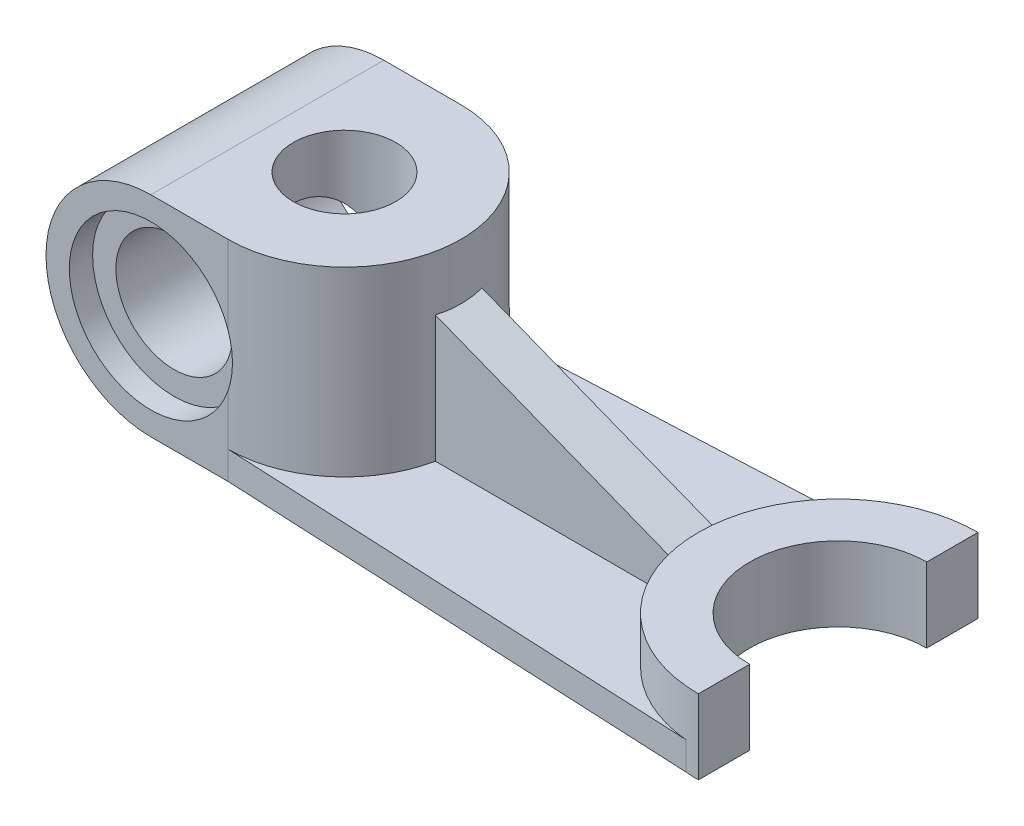
ISO-10303-21;
HEADER;
FILE_DESCRIPTION(('STEP AP214'),'2;1');
FILE_NAME('part.step','',(''),(''),'','','');
FILE_SCHEMA(('AUTOMOTIVE_DESIGN { 1 0 10303 214 1 1 1 1 }'));
ENDSEC;
DATA;
#1=APPLICATION_CONTEXT('core data for automotive mechanical design processes');
#2=APPLICATION_PROTOCOL_DEFINITION('international standard','automotive_design',2000,#1);
#3=PRODUCT_CONTEXT('',#1,'mechanical');
#4=PRODUCT('Part','Part','',(#3));
#5=PRODUCT_RELATED_PRODUCT_CATEGORY('part','',(#4));
#6=PRODUCT_DEFINITION_FORMATION('','',#4);
#7=PRODUCT_DEFINITION_CONTEXT('part definition',#1,'design');
#8=PRODUCT_DEFINITION('design','',#6,#7);
#9=PRODUCT_DEFINITION_SHAPE('','',#8);
#10=(LENGTH_UNIT() NAMED_UNIT(*) SI_UNIT(.MILLI.,.METRE.));
#11=(NAMED_UNIT(*) PLANE_ANGLE_UNIT() SI_UNIT($,.RADIAN.));
#12=(NAMED_UNIT(*) SI_UNIT($,.STERADIAN.) SOLID_ANGLE_UNIT());
#13=UNCERTAINTY_MEASURE_WITH_UNIT(LENGTH_MEASURE(1.E-05),#10,'distance_accuracy_value','');
#14=(GEOMETRIC_REPRESENTATION_CONTEXT(3) GLOBAL_UNCERTAINTY_ASSIGNED_CONTEXT((#13)) GLOBAL_UNIT_ASSIGNED_CONTEXT((#10,
#11,#12)) REPRESENTATION_CONTEXT('',''));
#15=CARTESIAN_POINT('',(0.,0.,0.));
#16=DIRECTION('',(0.,0.,1.));
#17=DIRECTION('',(1.,0.,0.));
#18=AXIS2_PLACEMENT_3D('',#15,#16,#17);
#19=CARTESIAN_POINT('',(0.,6.,0.));
#20=DIRECTION('',(0.,1.,0.));
#21=DIRECTION('',(0.,0.,1.));
#22=AXIS2_PLACEMENT_3D('',#19,#20,#21);
#23=PLANE('',#22);
#24=CARTESIAN_POINT('',(-105.941325387769,6.,0.));
#25=DIRECTION('',(0.,1.,0.));
#26=DIRECTION('',(0.,0.,1.));
#27=AXIS2_PLACEMENT_3D('',#24,#25,#26);
#28=CIRCLE('',#27,25.);
#29=CARTESIAN_POINT('',(-81.4464279599371,6.,-5.));
#30=VERTEX_POINT('',#29);
#31=CARTESIAN_POINT('',(-105.941325387769,6.00000000000001,-25.));
#32=VERTEX_POINT('',#31);
#33=EDGE_CURVE('E270',#30,#32,#28,.T.);
#34=ORIENTED_EDGE('',*,*,#33,.F.);
#35=DIRECTION('',(1.,0.,0.));
#36=VECTOR('',#35,1.);
#37=CARTESIAN_POINT('',(0.,6.,-5.));
#38=LINE('',#37,#36);
#39=CARTESIAN_POINT('',(-29.5803989154981,6.,-5.));
#40=VERTEX_POINT('',#39);
#41=EDGE_CURVE('E58',#30,#40,#38,.T.);
#42=ORIENTED_EDGE('',*,*,#41,.T.);
#43=CARTESIAN_POINT('',(0.,6.,0.));
#44=DIRECTION('',(0.,1.,0.));
#45=DIRECTION('',(0.,0.,1.));
#46=AXIS2_PLACEMENT_3D('',#43,#44,#45);
#47=CIRCLE('',#46,30.);
#48=CARTESIAN_POINT('',(-2.82546255822009,6.,-29.8666496502721));
#49=VERTEX_POINT('',#48);
#50=EDGE_CURVE('E262',#49,#40,#47,.T.);
#51=ORIENTED_EDGE('',*,*,#50,.F.);
#52=DIRECTION('',(0.998888128956993,0.,-0.0471434600851385));
#53=VECTOR('',#52,1.);
#54=CARTESIAN_POINT('',(-1.41273127911008,6.,-29.933324825136));
#55=LINE('',#54,#53);
#56=EDGE_CURVE('E266',#32,#49,#55,.T.);
#57=ORIENTED_EDGE('',*,*,#56,.F.);
#58=EDGE_LOOP('',(#34,#42,#51,#57));
#59=FACE_BOUND('',#58,.T.);
#60=ADVANCED_FACE('F42',(#59),#23,.T.);
#61=CARTESIAN_POINT('',(0.,16.,0.));
#62=DIRECTION('',(0.,-1.,0.));
#63=DIRECTION('',(0.,0.,-1.));
#64=AXIS2_PLACEMENT_3D('',#61,#62,#63);
#65=CYLINDRICAL_SURFACE('',#64,19.);
#66=DIRECTION('',(0.,-1.,0.));
#67=VECTOR('',#66,1.);
#68=CARTESIAN_POINT('',(0.,16.,19.));
#69=LINE('',#68,#67);
#70=CARTESIAN_POINT('',(0.,16.,19.));
#71=VERTEX_POINT('',#70);
#72=CARTESIAN_POINT('',(0.,0.,19.));
#73=VERTEX_POINT('',#72);
#74=EDGE_CURVE('E314',#71,#73,#69,.T.);
#75=ORIENTED_EDGE('',*,*,#74,.T.);
#76=CARTESIAN_POINT('',(0.,0.,0.));
#77=DIRECTION('',(0.,1.,0.));
#78=DIRECTION('',(0.,0.,1.));
#79=AXIS2_PLACEMENT_3D('',#76,#77,#78);
#80=CIRCLE('',#79,19.);
#81=CARTESIAN_POINT('',(0.,0.,-19.));
#82=VERTEX_POINT('',#81);
#83=EDGE_CURVE('E297',#82,#73,#80,.T.);
#84=ORIENTED_EDGE('',*,*,#83,.F.);
#85=DIRECTION('',(0.,-1.,0.));
#86=VECTOR('',#85,1.);
#87=CARTESIAN_POINT('',(0.,16.,-19.));
#88=LINE('',#87,#86);
#89=CARTESIAN_POINT('',(0.,16.,-19.));
#90=VERTEX_POINT('',#89);
#91=EDGE_CURVE('E51',#90,#82,#88,.T.);
#92=ORIENTED_EDGE('',*,*,#91,.F.);
#93=CARTESIAN_POINT('',(0.,16.,0.));
#94=DIRECTION('',(0.,1.,0.));
#95=DIRECTION('',(0.,0.,1.));
#96=AXIS2_PLACEMENT_3D('',#93,#94,#95);
#97=CIRCLE('',#96,19.);
#98=EDGE_CURVE('E298',#90,#71,#97,.T.);
#99=ORIENTED_EDGE('',*,*,#98,.T.);
#100=EDGE_LOOP('',(#75,#84,#92,#99));
#101=FACE_BOUND('',#100,.T.);
#102=ADVANCED_FACE('F44',(#101),#65,.F.);
#103=CARTESIAN_POINT('',(0.,16.,0.));
#104=DIRECTION('',(1.,0.,0.));
#105=DIRECTION('',(0.,0.,-1.));
#106=AXIS2_PLACEMENT_3D('',#103,#104,#105);
#107=PLANE('',#106);
#108=DIRECTION('',(0.,0.,1.));
#109=VECTOR('',#108,1.);
#110=CARTESIAN_POINT('',(0.,0.,0.));
#111=LINE('',#110,#109);
#112=CARTESIAN_POINT('',(0.,0.,-30.));
#113=VERTEX_POINT('',#112);
#114=EDGE_CURVE('E317',#113,#82,#111,.T.);
#115=ORIENTED_EDGE('',*,*,#114,.F.);
#116=DIRECTION('',(0.,-1.,0.));
#117=VECTOR('',#116,1.);
#118=CARTESIAN_POINT('',(0.,16.,-30.));
#119=LINE('',#118,#117);
#120=CARTESIAN_POINT('',(0.,16.,-30.));
#121=VERTEX_POINT('',#120);
#122=EDGE_CURVE('E335',#121,#113,#119,.T.);
#123=ORIENTED_EDGE('',*,*,#122,.F.);
#124=DIRECTION('',(0.,0.,1.));
#125=VECTOR('',#124,1.);
#126=CARTESIAN_POINT('',(0.,16.,0.));
#127=LINE('',#126,#125);
#128=EDGE_CURVE('E302',#121,#90,#127,.T.);
#129=ORIENTED_EDGE('',*,*,#128,.T.);
#130=ORIENTED_EDGE('',*,*,#91,.T.);
#131=EDGE_LOOP('',(#115,#123,#129,#130));
#132=FACE_BOUND('',#131,.T.);
#133=ADVANCED_FACE('F341',(#132),#107,.T.);
#134=CARTESIAN_POINT('',(0.,16.,0.));
#135=DIRECTION('',(0.,-1.,0.));
#136=DIRECTION('',(0.,0.,-1.));
#137=AXIS2_PLACEMENT_3D('',#134,#135,#136);
#138=CYLINDRICAL_SURFACE('',#137,30.);
#139=CARTESIAN_POINT('',(0.,1.22174343849992,0.));
#140=DIRECTION('',(-0.365451906112966,-0.930830223144049,0.));
#141=DIRECTION('',(0.930830223144049,-0.365451906112966,0.));
#142=AXIS2_PLACEMENT_3D('',#139,#140,#141);
#143=ELLIPSE('',#142,32.2292930054092,30.);
#144=CARTESIAN_POINT('',(-29.5803989154981,12.8352610257751,-5.));
#145=VERTEX_POINT('',#144);
#146=CARTESIAN_POINT('',(-29.5803989154981,12.8352610257751,5.));
#147=VERTEX_POINT('',#146);
#148=EDGE_CURVE('E171',#145,#147,#143,.F.);
#149=ORIENTED_EDGE('',*,*,#148,.T.);
#150=DIRECTION('',(0.,-1.,0.));
#151=VECTOR('',#150,1.);
#152=CARTESIAN_POINT('',(-29.5803989154981,16.,5.));
#153=LINE('',#152,#151);
#154=CARTESIAN_POINT('',(-29.5803989154981,6.,5.));
#155=VERTEX_POINT('',#154);
#156=EDGE_CURVE('E189',#147,#155,#153,.T.);
#157=ORIENTED_EDGE('',*,*,#156,.T.);
#158=CARTESIAN_POINT('',(-2.82546255822006,6.,29.8666496502721));
#159=VERTEX_POINT('',#158);
#160=EDGE_CURVE('E66',#155,#159,#47,.T.);
#161=ORIENTED_EDGE('',*,*,#160,.T.);
#162=DIRECTION('',(0.,-1.,0.));
#163=VECTOR('',#162,1.);
#164=CARTESIAN_POINT('',(-2.82546255822006,6.,29.8666496502721));
#165=LINE('',#164,#163);
#166=CARTESIAN_POINT('',(-2.82546255822006,0.,29.8666496502721));
#167=VERTEX_POINT('',#166);
#168=EDGE_CURVE('E276',#159,#167,#165,.T.);
#169=ORIENTED_EDGE('',*,*,#168,.T.);
#170=CARTESIAN_POINT('',(0.,0.,0.));
#171=DIRECTION('',(0.,1.,0.));
#172=DIRECTION('',(0.,0.,1.));
#173=AXIS2_PLACEMENT_3D('',#170,#171,#172);
#174=CIRCLE('',#173,30.);
#175=CARTESIAN_POINT('',(0.,0.,30.));
#176=VERTEX_POINT('',#175);
#177=EDGE_CURVE('E321',#167,#176,#174,.T.);
#178=ORIENTED_EDGE('',*,*,#177,.T.);
#179=DIRECTION('',(0.,-1.,0.));
#180=VECTOR('',#179,1.);
#181=CARTESIAN_POINT('',(0.,16.,30.));
#182=LINE('',#181,#180);
#183=CARTESIAN_POINT('',(0.,16.,30.));
#184=VERTEX_POINT('',#183);
#185=EDGE_CURVE('E331',#184,#176,#182,.T.);
#186=ORIENTED_EDGE('',*,*,#185,.F.);
#187=CARTESIAN_POINT('',(0.,16.,0.));
#188=DIRECTION('',(0.,1.,0.));
#189=DIRECTION('',(0.,0.,1.));
#190=AXIS2_PLACEMENT_3D('',#187,#188,#189);
#191=CIRCLE('',#190,30.);
#192=EDGE_CURVE('E307',#121,#184,#191,.T.);
#193=ORIENTED_EDGE('',*,*,#192,.F.);
#194=ORIENTED_EDGE('',*,*,#122,.T.);
#195=CARTESIAN_POINT('',(-2.82546255822009,0.,-29.8666496502721));
#196=VERTEX_POINT('',#195);
#197=EDGE_CURVE('E322',#113,#196,#174,.T.);
#198=ORIENTED_EDGE('',*,*,#197,.T.);
#199=DIRECTION('',(0.,-1.,0.));
#200=VECTOR('',#199,1.);
#201=CARTESIAN_POINT('',(-2.82546255822009,6.,-29.8666496502721));
#202=LINE('',#201,#200);
#203=EDGE_CURVE('E293',#49,#196,#202,.T.);
#204=ORIENTED_EDGE('',*,*,#203,.F.);
#205=ORIENTED_EDGE('',*,*,#50,.T.);
#206=DIRECTION('',(0.,-1.,0.));
#207=VECTOR('',#206,1.);
#208=CARTESIAN_POINT('',(-29.5803989154981,16.,-5.));
#209=LINE('',#208,#207);
#210=EDGE_CURVE('E185',#145,#40,#209,.T.);
#211=ORIENTED_EDGE('',*,*,#210,.F.);
#212=EDGE_LOOP('',(#149,#157,#161,#169,#178,#186,#193,#194,#198,#204,#205,#211));
#213=FACE_BOUND('',#212,.T.);
#214=ADVANCED_FACE('F351',(#213),#138,.T.);
#215=CARTESIAN_POINT('',(0.,16.,0.));
#216=DIRECTION('',(1.,0.,0.));
#217=DIRECTION('',(0.,0.,-1.));
#218=AXIS2_PLACEMENT_3D('',#215,#216,#217);
#219=PLANE('',#218);
#220=DIRECTION('',(0.,0.,1.));
#221=VECTOR('',#220,1.);
#222=CARTESIAN_POINT('',(0.,0.,0.));
#223=LINE('',#222,#221);
#224=EDGE_CURVE('E303',#73,#176,#223,.T.);
#225=ORIENTED_EDGE('',*,*,#224,.F.);
#226=ORIENTED_EDGE('',*,*,#74,.F.);
#227=DIRECTION('',(0.,0.,1.));
#228=VECTOR('',#227,1.);
#229=CARTESIAN_POINT('',(0.,16.,0.));
#230=LINE('',#229,#228);
#231=EDGE_CURVE('E310',#71,#184,#230,.T.);
#232=ORIENTED_EDGE('',*,*,#231,.T.);
#233=ORIENTED_EDGE('',*,*,#185,.T.);
#234=EDGE_LOOP('',(#225,#226,#232,#233));
#235=FACE_BOUND('',#234,.T.);
#236=ADVANCED_FACE('F458',(#235),#219,.T.);
#237=CARTESIAN_POINT('',(0.,16.,0.));
#238=DIRECTION('',(0.,1.,0.));
#239=DIRECTION('',(0.,0.,1.));
#240=AXIS2_PLACEMENT_3D('',#237,#238,#239);
#241=PLANE('',#240);
#242=ORIENTED_EDGE('',*,*,#98,.F.);
#243=ORIENTED_EDGE('',*,*,#128,.F.);
#244=ORIENTED_EDGE('',*,*,#192,.T.);
#245=ORIENTED_EDGE('',*,*,#231,.F.);
#246=EDGE_LOOP('',(#242,#243,#244,#245));
#247=FACE_BOUND('',#246,.T.);
#248=ADVANCED_FACE('F455',(#247),#241,.T.);
#249=CARTESIAN_POINT('',(0.,0.,0.));
#250=DIRECTION('',(0.,1.,0.));
#251=DIRECTION('',(0.,0.,1.));
#252=AXIS2_PLACEMENT_3D('',#249,#250,#251);
#253=PLANE('',#252);
#254=CARTESIAN_POINT('',(-105.941325387769,0.,0.));
#255=DIRECTION('',(0.,1.,0.));
#256=DIRECTION('',(0.,0.,1.));
#257=AXIS2_PLACEMENT_3D('',#254,#255,#256);
#258=CIRCLE('',#257,11.);
#259=CARTESIAN_POINT('',(-105.941325387769,0.,11.));
#260=VERTEX_POINT('',#259);
#261=EDGE_CURVE('E398',#260,#260,#258,.T.);
#262=ORIENTED_EDGE('',*,*,#261,.T.);
#263=EDGE_LOOP('',(#262));
#264=FACE_BOUND('',#263,.T.);
#265=DIRECTION('',(1.,0.,0.));
#266=VECTOR('',#265,1.);
#267=CARTESIAN_POINT('',(0.,0.,25.));
#268=LINE('',#267,#266);
#269=CARTESIAN_POINT('',(-122.5,0.,25.));
#270=VERTEX_POINT('',#269);
#271=CARTESIAN_POINT('',(-105.941325387769,0.,25.));
#272=VERTEX_POINT('',#271);
#273=EDGE_CURVE('E388',#270,#272,#268,.T.);
#274=ORIENTED_EDGE('',*,*,#273,.F.);
#275=DIRECTION('',(0.,0.,1.));
#276=VECTOR('',#275,1.);
#277=CARTESIAN_POINT('',(-122.5,0.,0.));
#278=LINE('',#277,#276);
#279=CARTESIAN_POINT('',(-122.5,0.,-25.));
#280=VERTEX_POINT('',#279);
#281=EDGE_CURVE('E392',#280,#270,#278,.T.);
#282=ORIENTED_EDGE('',*,*,#281,.F.);
#283=DIRECTION('',(1.,0.,0.));
#284=VECTOR('',#283,1.);
#285=CARTESIAN_POINT('',(0.,0.,-25.));
#286=LINE('',#285,#284);
#287=CARTESIAN_POINT('',(-105.941325387769,0.,-25.));
#288=VERTEX_POINT('',#287);
#289=EDGE_CURVE('E395',#280,#288,#286,.T.);
#290=ORIENTED_EDGE('',*,*,#289,.T.);
#291=DIRECTION('',(0.998888128956993,0.,-0.0471434600851385));
#292=VECTOR('',#291,1.);
#293=CARTESIAN_POINT('',(-1.41273127911008,0.,-29.933324825136));
#294=LINE('',#293,#292);
#295=EDGE_CURVE('E259',#288,#196,#294,.T.);
#296=ORIENTED_EDGE('',*,*,#295,.T.);
#297=ORIENTED_EDGE('',*,*,#197,.F.);
#298=ORIENTED_EDGE('',*,*,#114,.T.);
#299=ORIENTED_EDGE('',*,*,#83,.T.);
#300=ORIENTED_EDGE('',*,*,#224,.T.);
#301=ORIENTED_EDGE('',*,*,#177,.F.);
#302=DIRECTION('',(0.998888128956993,0.,0.0471434600851386));
#303=VECTOR('',#302,1.);
#304=CARTESIAN_POINT('',(-1.41273127911008,0.,29.933324825136));
#305=LINE('',#304,#303);
#306=EDGE_CURVE('E280',#272,#167,#305,.T.);
#307=ORIENTED_EDGE('',*,*,#306,.F.);
#308=EDGE_LOOP('',(#274,#282,#290,#296,#297,#298,#299,#300,#301,#307));
#309=FACE_BOUND('',#308,.T.);
#310=ADVANCED_FACE('F349',(#264,#309),#253,.F.);
#311=CARTESIAN_POINT('',(-1.41273127911008,6.,-29.933324825136));
#312=DIRECTION('',(-0.0471434600851385,0.,-0.998888128956992));
#313=DIRECTION('',(-0.998888128956993,0.,0.0471434600851385));
#314=AXIS2_PLACEMENT_3D('',#311,#312,#313);
#315=PLANE('',#314);
#316=ORIENTED_EDGE('',*,*,#295,.F.);
#317=DIRECTION('',(0.,-1.,0.));
#318=VECTOR('',#317,1.);
#319=CARTESIAN_POINT('',(-105.941325387769,6.,-25.));
#320=LINE('',#319,#318);
#321=EDGE_CURVE('E289',#32,#288,#320,.T.);
#322=ORIENTED_EDGE('',*,*,#321,.F.);
#323=ORIENTED_EDGE('',*,*,#56,.T.);
#324=ORIENTED_EDGE('',*,*,#203,.T.);
#325=EDGE_LOOP('',(#316,#322,#323,#324));
#326=FACE_BOUND('',#325,.T.);
#327=ADVANCED_FACE('F355',(#326),#315,.T.);
#328=CARTESIAN_POINT('',(-1.41273127911008,6.,29.933324825136));
#329=DIRECTION('',(0.0471434600851386,0.,-0.998888128956992));
#330=DIRECTION('',(-0.998888128956993,0.,-0.0471434600851387));
#331=AXIS2_PLACEMENT_3D('',#328,#329,#330);
#332=PLANE('',#331);
#333=ORIENTED_EDGE('',*,*,#306,.T.);
#334=ORIENTED_EDGE('',*,*,#168,.F.);
#335=DIRECTION('',(0.998888128956993,0.,0.0471434600851386));
#336=VECTOR('',#335,1.);
#337=CARTESIAN_POINT('',(-1.41273127911008,6.,29.933324825136));
#338=LINE('',#337,#336);
#339=CARTESIAN_POINT('',(-105.941325387769,6.,25.));
#340=VERTEX_POINT('',#339);
#341=EDGE_CURVE('E273',#340,#159,#338,.T.);
#342=ORIENTED_EDGE('',*,*,#341,.F.);
#343=DIRECTION('',(0.,-1.,0.));
#344=VECTOR('',#343,1.);
#345=CARTESIAN_POINT('',(-105.941325387769,6.,25.));
#346=LINE('',#345,#344);
#347=EDGE_CURVE('E286',#340,#272,#346,.T.);
#348=ORIENTED_EDGE('',*,*,#347,.T.);
#349=EDGE_LOOP('',(#333,#334,#342,#348));
#350=FACE_BOUND('',#349,.T.);
#351=ADVANCED_FACE('F446',(#350),#332,.F.);
#352=DIRECTION('',(1.,0.,0.));
#353=VECTOR('',#352,1.);
#354=CARTESIAN_POINT('',(0.,6.,5.));
#355=LINE('',#354,#353);
#356=CARTESIAN_POINT('',(-81.4464279599371,6.00000000000001,5.));
#357=VERTEX_POINT('',#356);
#358=EDGE_CURVE('E184',#357,#155,#355,.T.);
#359=ORIENTED_EDGE('',*,*,#358,.F.);
#360=EDGE_CURVE('E180',#340,#357,#28,.T.);
#361=ORIENTED_EDGE('',*,*,#360,.F.);
#362=ORIENTED_EDGE('',*,*,#341,.T.);
#363=ORIENTED_EDGE('',*,*,#160,.F.);
#364=EDGE_LOOP('',(#359,#361,#362,#363));
#365=FACE_BOUND('',#364,.T.);
#366=ADVANCED_FACE('F232',(#365),#23,.T.);
#367=CARTESIAN_POINT('',(-122.5,22.5,-25.));
#368=DIRECTION('',(0.,0.,1.));
#369=DIRECTION('',(1.,0.,0.));
#370=AXIS2_PLACEMENT_3D('',#367,#368,#369);
#371=CYLINDRICAL_SURFACE('',#370,12.5);
#372=CARTESIAN_POINT('',(-110.,22.5,-10.2238525220208));
#373=CARTESIAN_POINT('',(-110.000001022945,22.8151175996059,-10.2238537066388));
#374=CARTESIAN_POINT('',(-110.011926243624,23.1302550897954,-10.2191425817717));
#375=CARTESIAN_POINT('',(-110.059527708891,23.7585519360189,-10.2000518813722));
#376=CARTESIAN_POINT('',(-110.095213100077,24.0717104833651,-10.1856685824658));
#377=CARTESIAN_POINT('',(-110.190087481997,24.6944059503296,-10.146460579179));
#378=CARTESIAN_POINT('',(-110.249320831511,25.0039348931828,-10.1216161632749));
#379=CARTESIAN_POINT('',(-110.390663217974,25.6165297578331,-10.0602844887872));
#380=CARTESIAN_POINT('',(-110.472769973659,25.9195963209081,-10.0237983912267));
#381=CARTESIAN_POINT('',(-110.659198618112,26.5179488101429,-9.93741700312008));
#382=CARTESIAN_POINT('',(-110.763589809973,26.8132071575252,-9.88747975053502));
#383=CARTESIAN_POINT('',(-110.993036225246,27.3925283770354,-9.7722408113993));
#384=CARTESIAN_POINT('',(-111.118092285661,27.6765907951096,-9.70693850246222));
#385=CARTESIAN_POINT('',(-111.386754082606,28.230657402423,-9.55880728769054));
#386=CARTESIAN_POINT('',(-111.530338410138,28.5006773199555,-9.47599854074103));
#387=CARTESIAN_POINT('',(-111.833531985217,29.0244133280762,-9.29050342624838));
#388=CARTESIAN_POINT('',(-111.993139241377,29.2781314382992,-9.18781952739188));
#389=CARTESIAN_POINT('',(-112.312786906056,29.7488344823683,-8.96878948673528));
#390=CARTESIAN_POINT('',(-112.471935413142,29.967148705193,-8.85399962738246));
#391=CARTESIAN_POINT('',(-112.797756064643,30.3858616061864,-8.60415437739193));
#392=CARTESIAN_POINT('',(-112.964427839248,30.5862611635192,-8.46909998211062));
#393=CARTESIAN_POINT('',(-113.30133415862,30.9675398046835,-8.17800522074864));
#394=CARTESIAN_POINT('',(-113.471565617939,31.1484350200518,-8.02198244079089));
#395=CARTESIAN_POINT('',(-113.811561649324,31.489944174186,-7.68869303383338));
#396=CARTESIAN_POINT('',(-113.981326275448,31.6505605670787,-7.51142898250559));
#397=CARTESIAN_POINT('',(-114.294386596953,31.9316637151588,-7.16060469717955));
#398=CARTESIAN_POINT('',(-114.438256911081,32.0546531501755,-6.98955229572364));
#399=CARTESIAN_POINT('',(-114.71973584134,32.2852229190041,-6.63258261720107));
#400=CARTESIAN_POINT('',(-114.857345060088,32.3928047379153,-6.44666677547723));
#401=CARTESIAN_POINT('',(-115.12385281115,32.593079846589,-6.06103457323356));
#402=CARTESIAN_POINT('',(-115.252749704378,32.6857703392786,-5.8613156300968));
#403=CARTESIAN_POINT('',(-115.49962686798,32.8569954597636,-5.44945129143081));
#404=CARTESIAN_POINT('',(-115.617606861018,32.9355297279786,-5.23730558043225));
#405=CARTESIAN_POINT('',(-115.838424071545,33.0778210164154,-4.80673822080588));
#406=CARTESIAN_POINT('',(-115.941530109412,33.141856942164,-4.58854620393093));
#407=CARTESIAN_POINT('',(-116.134101888772,33.2581596876239,-4.14320673243514));
#408=CARTESIAN_POINT('',(-116.223567973314,33.3104268033404,-3.91605950322188));
#409=CARTESIAN_POINT('',(-116.387758555141,33.4041021949439,-3.45428658995671));
#410=CARTESIAN_POINT('',(-116.462480726164,33.4455087576154,-3.21965973255805));
#411=CARTESIAN_POINT('',(-116.596316153716,33.5182720654722,-2.74446938814897));
#412=CARTESIAN_POINT('',(-116.655428677264,33.5496283387423,-2.50390562293991));
#413=CARTESIAN_POINT('',(-116.760602412437,33.604641648004,-2.00317450612015));
#414=CARTESIAN_POINT('',(-116.805618495407,33.6276958412725,-1.7427208724198));
#415=CARTESIAN_POINT('',(-116.876820581875,33.6638454863499,-1.21856769843325));
#416=CARTESIAN_POINT('',(-116.90300590104,33.676940576233,-0.954868040536454));
#417=CARTESIAN_POINT('',(-116.936272899579,33.6935377895946,-0.425887468157912));
#418=CARTESIAN_POINT('',(-116.943348906047,33.6970370644056,-0.160606107540882));
#419=CARTESIAN_POINT('',(-116.938307908843,33.6945337786153,0.369731143632505));
#420=CARTESIAN_POINT('',(-116.926190573121,33.6885310536267,0.634787030208724));
#421=CARTESIAN_POINT('',(-116.882000768196,33.6664106942579,1.17374480630107));
#422=CARTESIAN_POINT('',(-116.849132936693,33.6498896718178,1.44756546951));
#423=CARTESIAN_POINT('',(-116.763115941063,33.6058764209976,1.99112124435901));
#424=CARTESIAN_POINT('',(-116.709966096788,33.5783838246898,2.26085621867213));
#425=CARTESIAN_POINT('',(-116.584039535012,33.5116522968964,2.79422867268796));
#426=CARTESIAN_POINT('',(-116.511263053832,33.4724135068448,3.05786622576748));
#427=CARTESIAN_POINT('',(-116.347052623059,33.3811789163871,3.57700242001666));
#428=CARTESIAN_POINT('',(-116.255619220802,33.3291834902132,3.83250129969615));
#429=CARTESIAN_POINT('',(-116.056895921424,33.2121194228326,4.32964655446535));
#430=CARTESIAN_POINT('',(-115.949857199489,33.1472528760069,4.57144077620119));
#431=CARTESIAN_POINT('',(-115.720644536142,33.0027938385019,5.04318112906964));
#432=CARTESIAN_POINT('',(-115.598470729383,32.9232014788314,5.27312736558507));
#433=CARTESIAN_POINT('',(-115.341197348058,32.7482054945721,5.71914681172377));
#434=CARTESIAN_POINT('',(-115.206106718951,32.6528127793647,5.93522945165905));
#435=CARTESIAN_POINT('',(-114.925493485025,32.4452141767395,6.35199337374307));
#436=CARTESIAN_POINT('',(-114.779971601063,32.3330094505423,6.55267571815742));
#437=CARTESIAN_POINT('',(-114.490795267001,32.0987009927459,6.92521905184587));
#438=CARTESIAN_POINT('',(-114.347593008587,31.97765492496,7.09809756583937));
#439=CARTESIAN_POINT('',(-114.057297359381,31.7200009791537,7.42827840523834));
#440=CARTESIAN_POINT('',(-113.910204155586,31.5833938479532,7.58558147747692));
#441=CARTESIAN_POINT('',(-113.614923883265,31.2947730028051,7.88416011908972));
#442=CARTESIAN_POINT('',(-113.466736917405,31.1427607182441,8.02543717288496));
#443=CARTESIAN_POINT('',(-113.172020218132,30.8238170296752,8.2919561575677));
#444=CARTESIAN_POINT('',(-113.02549049504,30.6568855328138,8.41719798864425));
#445=CARTESIAN_POINT('',(-112.740512338643,30.3135054499794,8.6489251443261));
#446=CARTESIAN_POINT('',(-112.601952715449,30.1374228798922,8.75581730380692));
#447=CARTESIAN_POINT('',(-112.331081171419,29.7728712491546,8.9554079686532));
#448=CARTESIAN_POINT('',(-112.198769107108,29.5844024731895,9.04810680007607));
#449=CARTESIAN_POINT('',(-111.942258702487,29.1961373989472,9.22023172590305));
#450=CARTESIAN_POINT('',(-111.818063004692,28.99633745064,9.29965351056923));
#451=CARTESIAN_POINT('',(-111.579437209768,28.5866670799655,9.4462325021433));
#452=CARTESIAN_POINT('',(-111.465007676694,28.3767960770264,9.5133890009123));
#453=CARTESIAN_POINT('',(-111.237713164113,27.9294757219714,9.64192894199095));
#454=CARTESIAN_POINT('',(-111.125859881277,27.6912195376367,9.70229413262003));
#455=CARTESIAN_POINT('',(-110.91660991202,27.2058409759769,9.81124161900869));
#456=CARTESIAN_POINT('',(-110.819213892426,26.95871819034,9.85982337133314));
#457=CARTESIAN_POINT('',(-110.639865017813,26.457042871946,9.94653985329371));
#458=CARTESIAN_POINT('',(-110.557918205878,26.2024874766395,9.98467049752834));
#459=CARTESIAN_POINT('',(-110.41027112936,25.6875107943976,10.0516213020984));
#460=CARTESIAN_POINT('',(-110.34457172844,25.4270891964346,10.0804409675143));
#461=CARTESIAN_POINT('',(-110.222579520777,24.8679177779045,10.132909125926));
#462=CARTESIAN_POINT('',(-110.168591463085,24.5685550977209,10.1554119087969));
#463=CARTESIAN_POINT('',(-110.082549231021,23.966124952917,10.1908009201981));
#464=CARTESIAN_POINT('',(-110.050496739939,23.6630572057937,10.2036864107242));
#465=CARTESIAN_POINT('',(-110.008608307042,23.0550111740493,10.2204560571992));
#466=CARTESIAN_POINT('',(-109.998781904457,22.750032125404,10.2243363482189));
#467=CARTESIAN_POINT('',(-110.001459135884,22.1401864586158,10.2232730057568));
#468=CARTESIAN_POINT('',(-110.013963231332,21.8353198429265,10.2183291899343));
#469=CARTESIAN_POINT('',(-110.062739956406,21.2077258742886,10.1987594875438));
#470=CARTESIAN_POINT('',(-110.100511773446,20.8851326112862,10.1835222708803));
#471=CARTESIAN_POINT('',(-110.200894551498,20.2445353002702,10.1419434064131));
#472=CARTESIAN_POINT('',(-110.263506960761,19.9265315209524,10.1156011111575));
#473=CARTESIAN_POINT('',(-110.412889980437,19.2974547812247,10.0504601892972));
#474=CARTESIAN_POINT('',(-110.499666211801,18.9863834516363,10.0116586641238));
#475=CARTESIAN_POINT('',(-110.696284320944,18.3737717225424,9.91978502757313));
#476=CARTESIAN_POINT('',(-110.806125189944,18.0722309068639,9.86671354029312));
#477=CARTESIAN_POINT('',(-111.044778915432,17.4874616915782,9.74537288834746));
#478=CARTESIAN_POINT('',(-111.173149135339,17.2039827305342,9.67744316417501));
#479=CARTESIAN_POINT('',(-111.448421088491,16.6512480590606,9.52348413344107));
#480=CARTESIAN_POINT('',(-111.595322889138,16.3819924003687,9.43745476104713));
#481=CARTESIAN_POINT('',(-111.904674294911,15.8606615161509,9.24508421348088));
#482=CARTESIAN_POINT('',(-112.067103446176,15.6085644178789,9.1387695805999));
#483=CARTESIAN_POINT('',(-112.404089843943,15.1237064324681,8.90364149543406));
#484=CARTESIAN_POINT('',(-112.578644914788,14.8909420929763,8.7748320729644));
#485=CARTESIAN_POINT('',(-112.914596909919,14.4729623985485,8.50962694167597));
#486=CARTESIAN_POINT('',(-113.075139688963,14.2853711681279,8.3758877720405));
#487=CARTESIAN_POINT('',(-113.398843332787,13.9281254756705,8.08901500004514));
#488=CARTESIAN_POINT('',(-113.562003982512,13.7584695488636,7.9358829837408));
#489=CARTESIAN_POINT('',(-113.887199339742,13.4378921722963,7.61025614565749));
#490=CARTESIAN_POINT('',(-114.049234508709,13.2869625569603,7.43776982621548));
#491=CARTESIAN_POINT('',(-114.368531016508,13.0039621091276,7.07394889454006));
#492=CARTESIAN_POINT('',(-114.525792666799,12.8718900441343,6.88261551550008));
#493=CARTESIAN_POINT('',(-114.815093816739,12.6398410425196,6.50434722627213));
#494=CARTESIAN_POINT('',(-114.94800189233,12.5379307614489,6.31925561423924));
#495=CARTESIAN_POINT('',(-115.204970883998,12.3482485517333,5.93616498195986));
#496=CARTESIAN_POINT('',(-115.329032570587,12.2604753909181,5.73816708872085));
#497=CARTESIAN_POINT('',(-115.566357064014,12.0983045277393,5.33051671207336));
#498=CARTESIAN_POINT('',(-115.679617707992,12.0239095016556,5.12086190767158));
#499=CARTESIAN_POINT('',(-115.89364940807,11.8876376373862,4.69135640068391));
#500=CARTESIAN_POINT('',(-115.99441992669,11.8257613378378,4.47150525988507));
#501=CARTESIAN_POINT('',(-116.183577346341,11.7127324416901,4.01960332914392));
#502=CARTESIAN_POINT('',(-116.271745893651,11.6617627193099,3.78741550599345));
#503=CARTESIAN_POINT('',(-116.432677118863,11.5708583262478,3.3156683954916));
#504=CARTESIAN_POINT('',(-116.505439788938,11.5309236611727,3.076109104395));
#505=CARTESIAN_POINT('',(-116.634731114297,11.4612492335766,2.59115108322503));
#506=CARTESIAN_POINT('',(-116.691256544975,11.4315114958697,2.34575120371397));
#507=CARTESIAN_POINT('',(-116.78745134801,11.3815592847705,1.85071361571247));
#508=CARTESIAN_POINT('',(-116.827120041823,11.3613451947358,1.60107573704787));
#509=CARTESIAN_POINT('',(-116.891184346004,11.3289405398179,1.08304269772772));
#510=CARTESIAN_POINT('',(-116.914441300026,11.317345597563,0.814468743141616));
#511=CARTESIAN_POINT('',(-116.941162923732,11.3040386547482,0.276089262189239));
#512=CARTESIAN_POINT('',(-116.94462678565,11.3023270575322,0.00628368600963115));
#513=CARTESIAN_POINT('',(-116.931722291202,11.3087383954894,-0.532814819948847));
#514=CARTESIAN_POINT('',(-116.915348304706,11.3168641225687,-0.802107582458597));
#515=CARTESIAN_POINT('',(-116.862935532,11.3431921364437,-1.33827856277172));
#516=CARTESIAN_POINT('',(-116.826896634984,11.3613944800191,-1.60515676696095));
#517=CARTESIAN_POINT('',(-116.734390265289,11.408989137701,-2.14141262335832));
#518=CARTESIAN_POINT('',(-116.677425409879,11.4386548983509,-2.41068054066273));
#519=CARTESIAN_POINT('',(-116.543947526813,11.5099518462479,-2.94272365937174));
#520=CARTESIAN_POINT('',(-116.467434017317,11.5515833284322,-3.20549870056319));
#521=CARTESIAN_POINT('',(-116.295921015884,11.6478542944098,-3.7224295404466));
#522=CARTESIAN_POINT('',(-116.20092625684,11.7024904486144,-3.97658752636728));
#523=CARTESIAN_POINT('',(-115.993861533779,11.8259809546585,-4.47427573616201));
#524=CARTESIAN_POINT('',(-115.881792378833,11.8948346328555,-4.71780646290581));
#525=CARTESIAN_POINT('',(-115.646266352891,12.0455637530263,-5.18461840036838));
#526=CARTESIAN_POINT('',(-115.523288091521,12.1269525146174,-5.40829808016191));
#527=CARTESIAN_POINT('',(-115.265180813092,12.3052964188767,-5.84203706466314));
#528=CARTESIAN_POINT('',(-115.130052104309,12.4022511666602,-6.05209671469995));
#529=CARTESIAN_POINT('',(-114.850250055489,12.6125373803137,-6.45690062294609));
#530=CARTESIAN_POINT('',(-114.705582724321,12.7258585886751,-6.65165435679243));
#531=CARTESIAN_POINT('',(-114.409507927844,12.96948769695,-7.02471270111988));
#532=CARTESIAN_POINT('',(-114.258100842728,13.0997946394866,-7.2030182377138));
#533=CARTESIAN_POINT('',(-113.961529068477,13.3686280785575,-7.53140828807792));
#534=CARTESIAN_POINT('',(-113.816588329619,13.5060885416258,-7.68256994869991));
#535=CARTESIAN_POINT('',(-113.526196762301,13.7958109474581,-7.96940267212654));
#536=CARTESIAN_POINT('',(-113.38074595849,13.9480721842349,-8.10507447311661));
#537=CARTESIAN_POINT('',(-113.091929257033,14.2668679013573,-8.36098719450388));
#538=CARTESIAN_POINT('',(-112.948563446034,14.4334029729152,-8.48122747522272));
#539=CARTESIAN_POINT('',(-112.666365213316,14.7799251447921,-8.70669107616583));
#540=CARTESIAN_POINT('',(-112.52753291924,14.9599126234016,-8.81191397384933));
#541=CARTESIAN_POINT('',(-112.255872548462,15.3333097864411,-9.00859469782366));
#542=CARTESIAN_POINT('',(-112.123081099154,15.526786941227,-9.09997481416309));
#543=CARTESIAN_POINT('',(-111.866245482797,15.9250913247422,-9.26924947328981));
#544=CARTESIAN_POINT('',(-111.742201335242,16.129918578765,-9.34714398602292));
#545=CARTESIAN_POINT('',(-111.504390587553,16.549803946227,-9.49060645351779));
#546=CARTESIAN_POINT('',(-111.390631394093,16.7648692650888,-9.55616556113781));
#547=CARTESIAN_POINT('',(-111.174800779371,17.2038041402629,-9.67605172147228));
#548=CARTESIAN_POINT('',(-111.072729829182,17.4276740509405,-9.73037832155162));
#549=CARTESIAN_POINT('',(-110.870442231069,17.9088136959154,-9.83454090659531));
#550=CARTESIAN_POINT('',(-110.771753141473,18.1669888354212,-9.88316588475078));
#551=CARTESIAN_POINT('',(-110.591252160727,18.6909916569091,-9.96936236860689));
#552=CARTESIAN_POINT('',(-110.509442731373,18.9568204486962,-10.0069322623312));
#553=CARTESIAN_POINT('',(-110.363587131537,19.4941863402646,-10.0722381355775));
#554=CARTESIAN_POINT('',(-110.299522909238,19.7657173344645,-10.0999841168112));
#555=CARTESIAN_POINT('',(-110.189623274528,20.3130993523029,-10.1467004707525));
#556=CARTESIAN_POINT('',(-110.143782677814,20.5889491240808,-10.1656733395085));
#557=CARTESIAN_POINT('',(-110.071570029467,21.1367103809442,-10.1952225037637));
#558=CARTESIAN_POINT('',(-110.044747354825,21.4085521290114,-10.2059936295471));
#559=CARTESIAN_POINT('',(-110.008961845992,21.9535909289054,-10.2203081456297));
#560=CARTESIAN_POINT('',(-109.999999113091,22.2267879884098,-10.223851494938));
#561=CARTESIAN_POINT('',(-110.,22.5,-10.2238525220208));
#562=B_SPLINE_CURVE_WITH_KNOTS('',3,(#372,#373,#374,#375,#376,#377,#378,#379,#380,#381,#382,
#383,#384,#385,#386,#387,#388,#389,#390,#391,#392,#393,#394,#395,#396,#397,#398,#399,#400,#401,
#402,#403,#404,#405,#406,#407,#408,#409,#410,#411,#412,#413,#414,#415,#416,#417,#418,#419,#420,
#421,#422,#423,#424,#425,#426,#427,#428,#429,#430,#431,#432,#433,#434,#435,#436,#437,#438,#439,
#440,#441,#442,#443,#444,#445,#446,#447,#448,#449,#450,#451,#452,#453,#454,#455,#456,#457,#458,
#459,#460,#461,#462,#463,#464,#465,#466,#467,#468,#469,#470,#471,#472,#473,#474,#475,#476,#477,
#478,#479,#480,#481,#482,#483,#484,#485,#486,#487,#488,#489,#490,#491,#492,#493,#494,#495,#496,
#497,#498,#499,#500,#501,#502,#503,#504,#505,#506,#507,#508,#509,#510,#511,#512,#513,#514,#515,
#516,#517,#518,#519,#520,#521,#522,#523,#524,#525,#526,#527,#528,#529,#530,#531,#532,#533,#534,
#535,#536,#537,#538,#539,#540,#541,#542,#543,#544,#545,#546,#547,#548,#549,#550,#551,#552,#553,
#554,#555,#556,#557,#558,#559,#560,#561),.UNSPECIFIED.,.T.,.F.,(4,2,2,2,2,2,2,2,2,2,2,2,2,2,2,2,
2,2,2,2,2,2,2,2,2,2,2,2,2,2,2,2,2,2,2,2,2,2,2,2,2,2,2,2,2,2,2,2,2,2,2,2,2,2,2,2,2,2,2,2,2,2,2,2,
2,2,2,2,2,2,2,2,2,2,2,2,2,2,2,2,2,2,2,2,2,2,2,2,2,2,2,2,2,2,4),(0.,0.945125915148473,
1.89061587184535,2.83789541210195,3.78508050983136,4.73525535780761,5.68546870077819,
6.63459376355538,7.5836010113602,8.46294260213948,9.34224101542177,10.2208065131243,
11.0992655854181,11.8636584059908,12.6279774991142,13.3924399886683,14.1569218934946,
14.905135020205,15.6533293259923,16.4016415860015,17.1499889781399,17.9450536432595,
18.7401472006117,19.5354767683486,20.3308200956572,21.1586706258307,21.986548919999,
22.8144172462298,23.6422612888045,24.4580107468289,25.2737529478534,26.0889342483997,
26.9040592695807,27.6682159392831,28.432335950369,29.1963851264185,29.9604390580467,
30.7043878667677,31.4483195824981,32.1924923120167,32.9367079929331,33.7459976203034,
34.5553245638483,35.3649674284462,36.1746533220568,37.0887270807381,38.0028709756746,
38.9174071382732,39.8319621990151,40.8062550880065,41.7806047884,42.7551813301293,
43.7297152556548,44.6839582749819,45.6382047651638,46.5912111271897,47.5440469382838,
48.3852577958292,49.2263998988189,50.0671739245189,50.9078929735188,51.6558658113702,
52.4037734217072,53.1518304840306,53.899919725815,54.6597102633305,55.4195011868782,
56.1794428956199,56.9394151918542,57.7479770139408,58.5565718335615,59.3653961922329,
60.1742251085046,61.0036743043888,61.8331439467176,62.6624014477812,63.4916196666848,
64.294327752224,65.0970154775324,65.8992022923892,66.7013439126575,67.4519475508579,
68.2025154033138,68.9531143587994,69.7037344295587,70.4584234751881,71.2131142027044,
71.9683441597861,72.7236045443561,73.5646531011781,74.4058242332118,75.2461364907604,
76.0862095227812,76.9056441985238,77.7250835215153),.UNSPECIFIED.);
#563=CARTESIAN_POINT('',(-110.,22.5,-10.2238525220208));
#564=VERTEX_POINT('',#563);
#565=EDGE_CURVE('E210',#564,#564,#562,.T.);
#566=ORIENTED_EDGE('',*,*,#565,.T.);
#567=EDGE_LOOP('',(#566));
#568=FACE_BOUND('',#567,.T.);
#569=CARTESIAN_POINT('',(-122.5,22.5,20.));
#570=DIRECTION('',(0.,0.,1.));
#571=DIRECTION('',(1.,0.,0.));
#572=AXIS2_PLACEMENT_3D('',#569,#570,#571);
#573=CIRCLE('',#572,12.5);
#574=CARTESIAN_POINT('',(-110.,22.5,20.));
#575=VERTEX_POINT('',#574);
#576=EDGE_CURVE('E203',#575,#575,#573,.F.);
#577=ORIENTED_EDGE('',*,*,#576,.F.);
#578=EDGE_LOOP('',(#577));
#579=FACE_BOUND('',#578,.T.);
#580=CARTESIAN_POINT('',(-122.5,22.5,-25.));
#581=DIRECTION('',(0.,0.,1.));
#582=DIRECTION('',(1.,0.,0.));
#583=AXIS2_PLACEMENT_3D('',#580,#581,#582);
#584=CIRCLE('',#583,12.5);
#585=CARTESIAN_POINT('',(-110.,22.5,-25.));
#586=VERTEX_POINT('',#585);
#587=EDGE_CURVE('E206',#586,#586,#584,.T.);
#588=ORIENTED_EDGE('',*,*,#587,.F.);
#589=EDGE_LOOP('',(#588));
#590=FACE_BOUND('',#589,.T.);
#591=ADVANCED_FACE('F226',(#568,#579,#590),#371,.F.);
#592=CARTESIAN_POINT('',(0.,45.,-25.));
#593=DIRECTION('',(0.,0.,-1.));
#594=DIRECTION('',(-1.,0.,0.));
#595=AXIS2_PLACEMENT_3D('',#592,#593,#594);
#596=PLANE('',#595);
#597=ORIENTED_EDGE('',*,*,#587,.T.);
#598=EDGE_LOOP('',(#597));
#599=FACE_BOUND('',#598,.T.);
#600=CARTESIAN_POINT('',(-122.5,22.5,-25.));
#601=DIRECTION('',(0.,0.,1.));
#602=DIRECTION('',(1.,0.,0.));
#603=AXIS2_PLACEMENT_3D('',#600,#601,#602);
#604=CIRCLE('',#603,22.5);
#605=CARTESIAN_POINT('',(-122.5,45.,-25.));
#606=VERTEX_POINT('',#605);
#607=EDGE_CURVE('E220',#606,#280,#604,.T.);
#608=ORIENTED_EDGE('',*,*,#607,.F.);
#609=DIRECTION('',(1.,0.,0.));
#610=VECTOR('',#609,1.);
#611=CARTESIAN_POINT('',(0.,45.,-25.));
#612=LINE('',#611,#610);
#613=CARTESIAN_POINT('',(-105.941325387769,45.,-25.));
#614=VERTEX_POINT('',#613);
#615=EDGE_CURVE('E380',#606,#614,#612,.T.);
#616=ORIENTED_EDGE('',*,*,#615,.T.);
#617=DIRECTION('',(0.,-1.,0.));
#618=VECTOR('',#617,1.);
#619=CARTESIAN_POINT('',(-105.941325387769,45.,-25.));
#620=LINE('',#619,#618);
#621=EDGE_CURVE('E368',#614,#32,#620,.T.);
#622=ORIENTED_EDGE('',*,*,#621,.T.);
#623=ORIENTED_EDGE('',*,*,#321,.T.);
#624=ORIENTED_EDGE('',*,*,#289,.F.);
#625=EDGE_LOOP('',(#608,#616,#622,#623,#624));
#626=FACE_BOUND('',#625,.T.);
#627=ADVANCED_FACE('F231',(#599,#626),#596,.T.);
#628=CARTESIAN_POINT('',(0.,45.,25.));
#629=DIRECTION('',(0.,0.,-1.));
#630=DIRECTION('',(-1.,0.,0.));
#631=AXIS2_PLACEMENT_3D('',#628,#629,#630);
#632=PLANE('',#631);
#633=DIRECTION('',(0.,-1.,0.));
#634=VECTOR('',#633,1.);
#635=CARTESIAN_POINT('',(-105.941325387769,45.,25.));
#636=LINE('',#635,#634);
#637=CARTESIAN_POINT('',(-105.941325387769,16.8378188755345,25.));
#638=VERTEX_POINT('',#637);
#639=EDGE_CURVE('E366',#638,#340,#636,.T.);
#640=ORIENTED_EDGE('',*,*,#639,.F.);
#641=CARTESIAN_POINT('',(-122.5,22.5,25.));
#642=DIRECTION('',(0.,0.,1.));
#643=DIRECTION('',(1.,0.,0.));
#644=AXIS2_PLACEMENT_3D('',#641,#642,#643);
#645=CIRCLE('',#644,17.5);
#646=CARTESIAN_POINT('',(-105.941325387769,28.1621811244655,25.));
#647=VERTEX_POINT('',#646);
#648=EDGE_CURVE('E198',#647,#638,#645,.T.);
#649=ORIENTED_EDGE('',*,*,#648,.F.);
#650=CARTESIAN_POINT('',(-105.941325387769,45.,25.));
#651=VERTEX_POINT('',#650);
#652=EDGE_CURVE('E260',#651,#647,#636,.T.);
#653=ORIENTED_EDGE('',*,*,#652,.F.);
#654=DIRECTION('',(1.,0.,0.));
#655=VECTOR('',#654,1.);
#656=CARTESIAN_POINT('',(0.,45.,25.));
#657=LINE('',#656,#655);
#658=CARTESIAN_POINT('',(-122.5,45.,25.));
#659=VERTEX_POINT('',#658);
#660=EDGE_CURVE('E374',#659,#651,#657,.T.);
#661=ORIENTED_EDGE('',*,*,#660,.F.);
#662=CARTESIAN_POINT('',(-122.5,22.5,25.));
#663=DIRECTION('',(0.,0.,1.));
#664=DIRECTION('',(1.,0.,0.));
#665=AXIS2_PLACEMENT_3D('',#662,#663,#664);
#666=CIRCLE('',#665,22.5);
#667=EDGE_CURVE('E219',#659,#270,#666,.T.);
#668=ORIENTED_EDGE('',*,*,#667,.T.);
#669=ORIENTED_EDGE('',*,*,#273,.T.);
#670=ORIENTED_EDGE('',*,*,#347,.F.);
#671=EDGE_LOOP('',(#640,#649,#653,#661,#668,#669,#670));
#672=FACE_BOUND('',#671,.T.);
#673=ADVANCED_FACE('F249',(#672),#632,.F.);
#674=CARTESIAN_POINT('',(-105.941325387769,45.,0.));
#675=DIRECTION('',(0.,-1.,0.));
#676=DIRECTION('',(0.,0.,-1.));
#677=AXIS2_PLACEMENT_3D('',#674,#675,#676);
#678=CYLINDRICAL_SURFACE('',#677,11.);
#679=ORIENTED_EDGE('',*,*,#565,.F.);
#680=EDGE_LOOP('',(#679));
#681=FACE_BOUND('',#680,.T.);
#682=ORIENTED_EDGE('',*,*,#261,.F.);
#683=EDGE_LOOP('',(#682));
#684=FACE_BOUND('',#683,.T.);
#685=CARTESIAN_POINT('',(-105.941325387769,45.,0.));
#686=DIRECTION('',(0.,1.,0.));
#687=DIRECTION('',(0.,0.,1.));
#688=AXIS2_PLACEMENT_3D('',#685,#686,#687);
#689=CIRCLE('',#688,11.);
#690=CARTESIAN_POINT('',(-105.941325387769,45.,11.));
#691=VERTEX_POINT('',#690);
#692=EDGE_CURVE('E384',#691,#691,#689,.T.);
#693=ORIENTED_EDGE('',*,*,#692,.T.);
#694=EDGE_LOOP('',(#693));
#695=FACE_BOUND('',#694,.T.);
#696=ADVANCED_FACE('F222',(#681,#684,#695),#678,.F.);
#697=CARTESIAN_POINT('',(-105.941325387769,45.,0.));
#698=DIRECTION('',(0.,-1.,0.));
#699=DIRECTION('',(0.,0.,-1.));
#700=AXIS2_PLACEMENT_3D('',#697,#698,#699);
#701=CYLINDRICAL_SURFACE('',#700,25.);
#702=DIRECTION('',(0.,-1.,0.));
#703=VECTOR('',#702,1.);
#704=CARTESIAN_POINT('',(-81.4464279599371,45.,5.));
#705=LINE('',#704,#703);
#706=CARTESIAN_POINT('',(-81.4464279599371,33.1983075894957,5.));
#707=VERTEX_POINT('',#706);
#708=EDGE_CURVE('E177',#707,#357,#705,.T.);
#709=ORIENTED_EDGE('',*,*,#708,.F.);
#710=CARTESIAN_POINT('',(-105.941325387769,42.8152138012501,0.));
#711=DIRECTION('',(-0.365451906112966,-0.930830223144049,0.));
#712=DIRECTION('',(0.930830223144049,-0.365451906112966,0.));
#713=AXIS2_PLACEMENT_3D('',#710,#711,#712);
#714=ELLIPSE('',#713,26.8577441711744,25.);
#715=CARTESIAN_POINT('',(-81.4464279599371,33.1983075894957,-5.));
#716=VERTEX_POINT('',#715);
#717=EDGE_CURVE('E11',#716,#707,#714,.T.);
#718=ORIENTED_EDGE('',*,*,#717,.F.);
#719=DIRECTION('',(0.,-1.,0.));
#720=VECTOR('',#719,1.);
#721=CARTESIAN_POINT('',(-81.4464279599371,45.,-5.));
#722=LINE('',#721,#720);
#723=EDGE_CURVE('E155',#716,#30,#722,.T.);
#724=ORIENTED_EDGE('',*,*,#723,.T.);
#725=ORIENTED_EDGE('',*,*,#33,.T.);
#726=ORIENTED_EDGE('',*,*,#621,.F.);
#727=CARTESIAN_POINT('',(-105.941325387769,45.,0.));
#728=DIRECTION('',(0.,1.,0.));
#729=DIRECTION('',(0.,0.,1.));
#730=AXIS2_PLACEMENT_3D('',#727,#728,#729);
#731=CIRCLE('',#730,25.);
#732=EDGE_CURVE('E370',#614,#651,#731,.F.);
#733=ORIENTED_EDGE('',*,*,#732,.T.);
#734=ORIENTED_EDGE('',*,*,#652,.T.);
#735=CARTESIAN_POINT('',(-105.941325387769,16.8378188755345,25.));
#736=CARTESIAN_POINT('',(-105.860640780454,17.0737767682343,24.9999957239409));
#737=CARTESIAN_POINT('',(-105.785010367925,17.3114286590134,24.9996100363036));
#738=CARTESIAN_POINT('',(-105.643971605166,17.7897457219038,24.9983317675358));
#739=CARTESIAN_POINT('',(-105.578563272411,18.0304108991654,24.9974391855388));
#740=CARTESIAN_POINT('',(-105.397874287863,18.7562345386469,24.994385537187));
#741=CARTESIAN_POINT('',(-105.298086675208,19.2453468350377,24.9918482942924));
#742=CARTESIAN_POINT('',(-105.142776619532,20.2169419444786,24.9873599357241));
#743=CARTESIAN_POINT('',(-105.086132684257,20.699247659655,24.9853948549194));
#744=CARTESIAN_POINT('',(-105.013111509534,21.666887468139,24.9827896330508));
#745=CARTESIAN_POINT('',(-104.996730989835,22.1522213115156,24.9821493840538));
#746=CARTESIAN_POINT('',(-105.004172864107,23.1002907911874,24.9824283834069));
#747=CARTESIAN_POINT('',(-105.026185337236,23.5630416792704,24.9832774339249));
#748=CARTESIAN_POINT('',(-105.106818343941,24.4853296405271,24.9861005397169));
#749=CARTESIAN_POINT('',(-105.165439011195,24.944866701959,24.988074599099));
#750=CARTESIAN_POINT('',(-105.320974233162,25.8699828381085,24.992426860333));
#751=CARTESIAN_POINT('',(-105.418860629655,26.3354002413776,24.9948143705228));
#752=CARTESIAN_POINT('',(-105.593816957505,27.0263107145498,24.9976516172357));
#753=CARTESIAN_POINT('',(-105.656835071717,27.2554453878422,24.9984734303997));
#754=CARTESIAN_POINT('',(-105.792147685425,27.7109602816774,24.9996458547429));
#755=CARTESIAN_POINT('',(-105.864442184295,27.9373405024061,24.9999964659539));
#756=CARTESIAN_POINT('',(-105.941325387769,28.1621811244655,25.));
#757=B_SPLINE_CURVE_WITH_KNOTS('',3,(#735,#736,#737,#738,#739,#740,#741,#742,#743,#744,#745,
#746,#747,#748,#749,#750,#751,#752,#753,#754,#755,#756),.UNSPECIFIED.,.F.,.F.,(4,2,2,2,2,2,2,2,
2,2,4),(0.,0.747992818574235,1.49598691578895,2.99157781833389,4.44682323985566,
5.90195009890069,7.29031980839419,8.67869458768496,10.1037910759988,10.8165529204311,
11.5293147167397),.UNSPECIFIED.);
#758=EDGE_CURVE('E251',#638,#647,#757,.T.);
#759=ORIENTED_EDGE('',*,*,#758,.F.);
#760=ORIENTED_EDGE('',*,*,#639,.T.);
#761=ORIENTED_EDGE('',*,*,#360,.T.);
#762=EDGE_LOOP('',(#709,#718,#724,#725,#726,#733,#734,#759,#760,#761));
#763=FACE_BOUND('',#762,.T.);
#764=ADVANCED_FACE('F175',(#763),#701,.T.);
#765=CARTESIAN_POINT('',(0.,45.,0.));
#766=DIRECTION('',(0.,1.,0.));
#767=DIRECTION('',(0.,0.,1.));
#768=AXIS2_PLACEMENT_3D('',#765,#766,#767);
#769=PLANE('',#768);
#770=ORIENTED_EDGE('',*,*,#692,.F.);
#771=EDGE_LOOP('',(#770));
#772=FACE_BOUND('',#771,.T.);
#773=DIRECTION('',(0.,0.,1.));
#774=VECTOR('',#773,1.);
#775=CARTESIAN_POINT('',(-122.5,45.,0.));
#776=LINE('',#775,#774);
#777=EDGE_CURVE('E377',#606,#659,#776,.T.);
#778=ORIENTED_EDGE('',*,*,#777,.T.);
#779=ORIENTED_EDGE('',*,*,#660,.T.);
#780=ORIENTED_EDGE('',*,*,#732,.F.);
#781=ORIENTED_EDGE('',*,*,#615,.F.);
#782=EDGE_LOOP('',(#778,#779,#780,#781));
#783=FACE_BOUND('',#782,.T.);
#784=ADVANCED_FACE('F241',(#772,#783),#769,.T.);
#785=CARTESIAN_POINT('',(-122.5,22.5,-25.));
#786=DIRECTION('',(0.,0.,1.));
#787=DIRECTION('',(1.,0.,0.));
#788=AXIS2_PLACEMENT_3D('',#785,#786,#787);
#789=CYLINDRICAL_SURFACE('',#788,22.5);
#790=ORIENTED_EDGE('',*,*,#667,.F.);
#791=ORIENTED_EDGE('',*,*,#777,.F.);
#792=ORIENTED_EDGE('',*,*,#607,.T.);
#793=ORIENTED_EDGE('',*,*,#281,.T.);
#794=EDGE_LOOP('',(#790,#791,#792,#793));
#795=FACE_BOUND('',#794,.T.);
#796=ADVANCED_FACE('F237',(#795),#789,.T.);
#797=CARTESIAN_POINT('',(-122.5,22.5,20.));
#798=DIRECTION('',(0.,0.,1.));
#799=DIRECTION('',(1.,0.,0.));
#800=AXIS2_PLACEMENT_3D('',#797,#798,#799);
#801=PLANE('',#800);
#802=CARTESIAN_POINT('',(-122.5,22.5,20.));
#803=DIRECTION('',(0.,0.,1.));
#804=DIRECTION('',(1.,0.,0.));
#805=AXIS2_PLACEMENT_3D('',#802,#803,#804);
#806=CIRCLE('',#805,17.5);
#807=CARTESIAN_POINT('',(-105.,22.5,20.));
#808=VERTEX_POINT('',#807);
#809=EDGE_CURVE('E199',#808,#808,#806,.T.);
#810=ORIENTED_EDGE('',*,*,#809,.T.);
#811=EDGE_LOOP('',(#810));
#812=FACE_BOUND('',#811,.T.);
#813=ORIENTED_EDGE('',*,*,#576,.T.);
#814=EDGE_LOOP('',(#813));
#815=FACE_BOUND('',#814,.T.);
#816=ADVANCED_FACE('F240',(#812,#815),#801,.T.);
#817=CARTESIAN_POINT('',(-122.5,22.5,20.));
#818=DIRECTION('',(0.,0.,1.));
#819=DIRECTION('',(1.,0.,0.));
#820=AXIS2_PLACEMENT_3D('',#817,#818,#819);
#821=CYLINDRICAL_SURFACE('',#820,17.5);
#822=ORIENTED_EDGE('',*,*,#758,.T.);
#823=ORIENTED_EDGE('',*,*,#648,.T.);
#824=EDGE_LOOP('',(#822,#823));
#825=FACE_BOUND('',#824,.T.);
#826=ORIENTED_EDGE('',*,*,#809,.F.);
#827=EDGE_LOOP('',(#826));
#828=FACE_BOUND('',#827,.T.);
#829=ADVANCED_FACE('F234',(#825,#828),#821,.F.);
#830=CARTESIAN_POINT('',(-80.9413253877689,33.,0.));
#831=DIRECTION('',(-0.365451906112966,-0.930830223144049,0.));
#832=DIRECTION('',(0.930830223144049,-0.365451906112966,0.));
#833=AXIS2_PLACEMENT_3D('',#830,#831,#832);
#834=PLANE('',#833);
#835=ORIENTED_EDGE('',*,*,#148,.F.);
#836=DIRECTION('',(0.930830223144049,-0.365451906112966,0.));
#837=VECTOR('',#836,1.);
#838=CARTESIAN_POINT('',(-80.9413253877689,33.,-5.));
#839=LINE('',#838,#837);
#840=EDGE_CURVE('E158',#716,#145,#839,.T.);
#841=ORIENTED_EDGE('',*,*,#840,.F.);
#842=ORIENTED_EDGE('',*,*,#717,.T.);
#843=DIRECTION('',(0.930830223144049,-0.365451906112966,0.));
#844=VECTOR('',#843,1.);
#845=CARTESIAN_POINT('',(-80.9413253877689,33.,5.));
#846=LINE('',#845,#844);
#847=EDGE_CURVE('E164',#707,#147,#846,.T.);
#848=ORIENTED_EDGE('',*,*,#847,.T.);
#849=EDGE_LOOP('',(#835,#841,#842,#848));
#850=FACE_BOUND('',#849,.T.);
#851=ADVANCED_FACE('F167',(#850),#834,.F.);
#852=CARTESIAN_POINT('',(-72.5,22.5,5.));
#853=DIRECTION('',(0.,0.,1.));
#854=DIRECTION('',(1.,0.,0.));
#855=AXIS2_PLACEMENT_3D('',#852,#853,#854);
#856=PLANE('',#855);
#857=ORIENTED_EDGE('',*,*,#156,.F.);
#858=ORIENTED_EDGE('',*,*,#847,.F.);
#859=ORIENTED_EDGE('',*,*,#708,.T.);
#860=ORIENTED_EDGE('',*,*,#358,.T.);
#861=EDGE_LOOP('',(#857,#858,#859,#860));
#862=FACE_BOUND('',#861,.T.);
#863=ADVANCED_FACE('F594',(#862),#856,.T.);
#864=CARTESIAN_POINT('',(-72.5,22.5,-5.));
#865=DIRECTION('',(0.,0.,1.));
#866=DIRECTION('',(1.,0.,0.));
#867=AXIS2_PLACEMENT_3D('',#864,#865,#866);
#868=PLANE('',#867);
#869=ORIENTED_EDGE('',*,*,#840,.T.);
#870=ORIENTED_EDGE('',*,*,#210,.T.);
#871=ORIENTED_EDGE('',*,*,#41,.F.);
#872=ORIENTED_EDGE('',*,*,#723,.F.);
#873=EDGE_LOOP('',(#869,#870,#871,#872));
#874=FACE_BOUND('',#873,.T.);
#875=ADVANCED_FACE('F157',(#874),#868,.F.);
#876=CLOSED_SHELL('',(#60,#102,#133,#214,#236,#248,#310,#327,#351,#366,#591,#627,#673,#696,#764,
#784,#796,#816,#829,#851,#863,#875));
#877=MANIFOLD_SOLID_BREP('B2',#876);
#878=ADVANCED_BREP_SHAPE_REPRESENTATION('',(#18,#877),#14);
#879=SHAPE_DEFINITION_REPRESENTATION(#9,#878);
ENDSEC;
END-ISO-10303-21;
